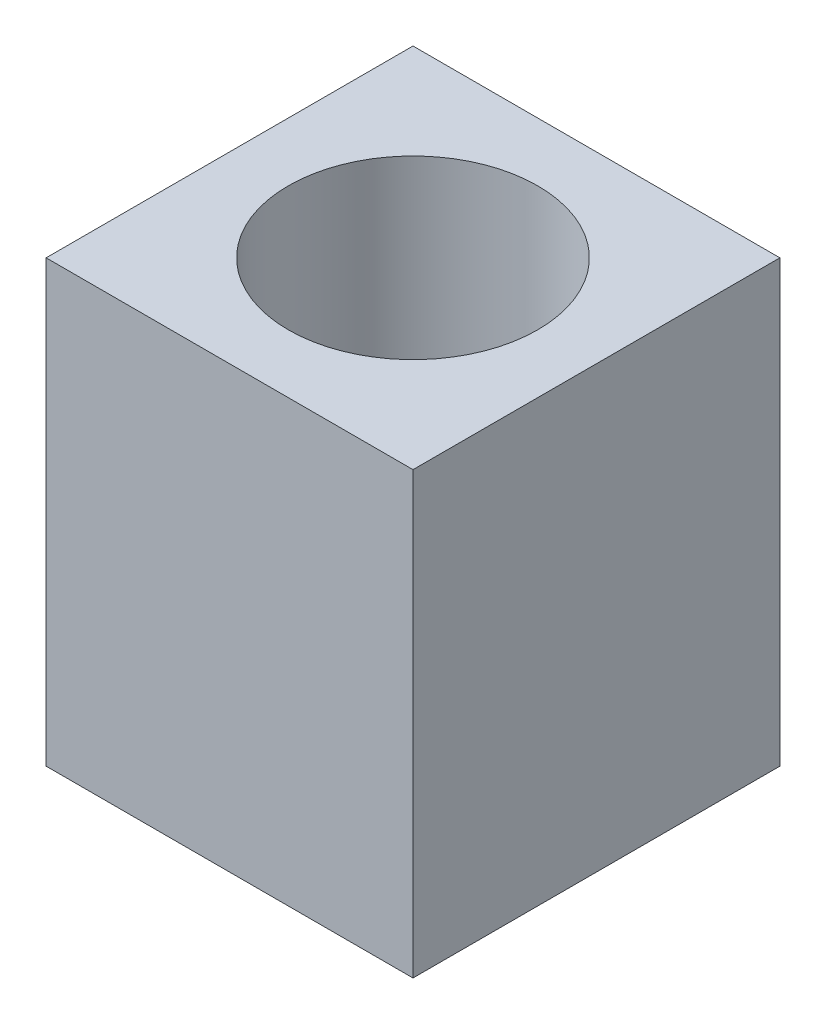
ISO-10303-21;
HEADER;
FILE_DESCRIPTION(('STEP AP214'),'2;1');
FILE_NAME('part.step','',(''),(''),'','','');
FILE_SCHEMA(('AUTOMOTIVE_DESIGN { 1 0 10303 214 1 1 1 1 }'));
ENDSEC;
DATA;
#1=APPLICATION_CONTEXT('core data for automotive mechanical design processes');
#2=APPLICATION_PROTOCOL_DEFINITION('international standard','automotive_design',2000,#1);
#3=PRODUCT_CONTEXT('',#1,'mechanical');
#4=PRODUCT('Part','Part','',(#3));
#5=PRODUCT_RELATED_PRODUCT_CATEGORY('part','',(#4));
#6=PRODUCT_DEFINITION_FORMATION('','',#4);
#7=PRODUCT_DEFINITION_CONTEXT('part definition',#1,'design');
#8=PRODUCT_DEFINITION('design','',#6,#7);
#9=PRODUCT_DEFINITION_SHAPE('','',#8);
#10=(LENGTH_UNIT() NAMED_UNIT(*) SI_UNIT(.MILLI.,.METRE.));
#11=(NAMED_UNIT(*) PLANE_ANGLE_UNIT() SI_UNIT($,.RADIAN.));
#12=(NAMED_UNIT(*) SI_UNIT($,.STERADIAN.) SOLID_ANGLE_UNIT());
#13=UNCERTAINTY_MEASURE_WITH_UNIT(LENGTH_MEASURE(1.E-05),#10,'distance_accuracy_value','');
#14=(GEOMETRIC_REPRESENTATION_CONTEXT(3) GLOBAL_UNCERTAINTY_ASSIGNED_CONTEXT((#13)) GLOBAL_UNIT_ASSIGNED_CONTEXT((#10,
#11,#12)) REPRESENTATION_CONTEXT('',''));
#15=CARTESIAN_POINT('',(0.,0.,0.));
#16=DIRECTION('',(0.,0.,1.));
#17=DIRECTION('',(1.,0.,0.));
#18=AXIS2_PLACEMENT_3D('',#15,#16,#17);
#19=CARTESIAN_POINT('',(0.,6.,0.));
#20=DIRECTION('',(0.,-1.,0.));
#21=DIRECTION('',(0.,0.,-1.));
#22=AXIS2_PLACEMENT_3D('',#19,#20,#21);
#23=PLANE('',#22);
#24=DIRECTION('',(0.,0.,-1.));
#25=VECTOR('',#24,1.);
#26=CARTESIAN_POINT('',(2.5,6.,2.5));
#27=LINE('',#26,#25);
#28=CARTESIAN_POINT('',(2.5,6.,2.5));
#29=VERTEX_POINT('',#28);
#30=CARTESIAN_POINT('',(2.5,6.,-2.5));
#31=VERTEX_POINT('',#30);
#32=EDGE_CURVE('E92',#29,#31,#27,.T.);
#33=ORIENTED_EDGE('',*,*,#32,.T.);
#34=DIRECTION('',(-1.,0.,0.));
#35=VECTOR('',#34,1.);
#36=CARTESIAN_POINT('',(-2.5,6.,-2.5));
#37=LINE('',#36,#35);
#38=CARTESIAN_POINT('',(-2.5,6.,-2.5));
#39=VERTEX_POINT('',#38);
#40=EDGE_CURVE('E87',#31,#39,#37,.T.);
#41=ORIENTED_EDGE('',*,*,#40,.T.);
#42=DIRECTION('',(0.,0.,1.));
#43=VECTOR('',#42,1.);
#44=CARTESIAN_POINT('',(-2.5,6.,2.5));
#45=LINE('',#44,#43);
#46=CARTESIAN_POINT('',(-2.5,6.,2.5));
#47=VERTEX_POINT('',#46);
#48=EDGE_CURVE('E90',#39,#47,#45,.T.);
#49=ORIENTED_EDGE('',*,*,#48,.T.);
#50=DIRECTION('',(1.,0.,0.));
#51=VECTOR('',#50,1.);
#52=CARTESIAN_POINT('',(-2.5,6.,2.5));
#53=LINE('',#52,#51);
#54=EDGE_CURVE('E57',#47,#29,#53,.T.);
#55=ORIENTED_EDGE('',*,*,#54,.T.);
#56=EDGE_LOOP('',(#33,#41,#49,#55));
#57=FACE_BOUND('',#56,.T.);
#58=CARTESIAN_POINT('',(0.,6.,0.));
#59=DIRECTION('',(0.,1.,0.));
#60=DIRECTION('',(0.,0.,1.));
#61=AXIS2_PLACEMENT_3D('',#58,#59,#60);
#62=CIRCLE('',#61,1.7);
#63=CARTESIAN_POINT('',(0.,6.,1.7));
#64=VERTEX_POINT('',#63);
#65=EDGE_CURVE('E112',#64,#64,#62,.T.);
#66=ORIENTED_EDGE('',*,*,#65,.F.);
#67=EDGE_LOOP('',(#66));
#68=FACE_BOUND('',#67,.T.);
#69=ADVANCED_FACE('F39',(#57,#68),#23,.F.);
#70=CARTESIAN_POINT('',(0.,0.,0.));
#71=DIRECTION('',(0.,-1.,0.));
#72=DIRECTION('',(0.,0.,-1.));
#73=AXIS2_PLACEMENT_3D('',#70,#71,#72);
#74=PLANE('',#73);
#75=DIRECTION('',(0.,0.,-1.));
#76=VECTOR('',#75,1.);
#77=CARTESIAN_POINT('',(2.5,0.,2.5));
#78=LINE('',#77,#76);
#79=CARTESIAN_POINT('',(2.5,0.,2.5));
#80=VERTEX_POINT('',#79);
#81=CARTESIAN_POINT('',(2.5,0.,-2.5));
#82=VERTEX_POINT('',#81);
#83=EDGE_CURVE('E108',#80,#82,#78,.T.);
#84=ORIENTED_EDGE('',*,*,#83,.F.);
#85=DIRECTION('',(1.,0.,0.));
#86=VECTOR('',#85,1.);
#87=CARTESIAN_POINT('',(-2.5,0.,2.5));
#88=LINE('',#87,#86);
#89=CARTESIAN_POINT('',(-2.5,0.,2.5));
#90=VERTEX_POINT('',#89);
#91=EDGE_CURVE('E80',#90,#80,#88,.T.);
#92=ORIENTED_EDGE('',*,*,#91,.F.);
#93=DIRECTION('',(0.,0.,1.));
#94=VECTOR('',#93,1.);
#95=CARTESIAN_POINT('',(-2.5,0.,2.5));
#96=LINE('',#95,#94);
#97=CARTESIAN_POINT('',(-2.5,0.,-2.5));
#98=VERTEX_POINT('',#97);
#99=EDGE_CURVE('E74',#98,#90,#96,.T.);
#100=ORIENTED_EDGE('',*,*,#99,.F.);
#101=DIRECTION('',(-1.,0.,0.));
#102=VECTOR('',#101,1.);
#103=CARTESIAN_POINT('',(-2.5,0.,-2.5));
#104=LINE('',#103,#102);
#105=EDGE_CURVE('E97',#82,#98,#104,.T.);
#106=ORIENTED_EDGE('',*,*,#105,.F.);
#107=EDGE_LOOP('',(#84,#92,#100,#106));
#108=FACE_BOUND('',#107,.T.);
#109=CARTESIAN_POINT('',(0.,0.,0.));
#110=DIRECTION('',(0.,1.,0.));
#111=DIRECTION('',(0.,0.,1.));
#112=AXIS2_PLACEMENT_3D('',#109,#110,#111);
#113=CIRCLE('',#112,1.7);
#114=CARTESIAN_POINT('',(0.,0.,1.7));
#115=VERTEX_POINT('',#114);
#116=EDGE_CURVE('E130',#115,#115,#113,.T.);
#117=ORIENTED_EDGE('',*,*,#116,.T.);
#118=EDGE_LOOP('',(#117));
#119=FACE_BOUND('',#118,.T.);
#120=ADVANCED_FACE('F125',(#108,#119),#74,.T.);
#121=CARTESIAN_POINT('',(2.5,6.,2.5));
#122=DIRECTION('',(-1.,0.,0.));
#123=DIRECTION('',(0.,0.,1.));
#124=AXIS2_PLACEMENT_3D('',#121,#122,#123);
#125=PLANE('',#124);
#126=ORIENTED_EDGE('',*,*,#83,.T.);
#127=DIRECTION('',(0.,-1.,0.));
#128=VECTOR('',#127,1.);
#129=CARTESIAN_POINT('',(2.5,6.,-2.5));
#130=LINE('',#129,#128);
#131=EDGE_CURVE('E11',#31,#82,#130,.T.);
#132=ORIENTED_EDGE('',*,*,#131,.F.);
#133=ORIENTED_EDGE('',*,*,#32,.F.);
#134=DIRECTION('',(0.,-1.,0.));
#135=VECTOR('',#134,1.);
#136=CARTESIAN_POINT('',(2.5,6.,2.5));
#137=LINE('',#136,#135);
#138=EDGE_CURVE('E104',#29,#80,#137,.T.);
#139=ORIENTED_EDGE('',*,*,#138,.T.);
#140=EDGE_LOOP('',(#126,#132,#133,#139));
#141=FACE_BOUND('',#140,.T.);
#142=ADVANCED_FACE('F41',(#141),#125,.F.);
#143=CARTESIAN_POINT('',(-2.5,6.,-2.5));
#144=DIRECTION('',(0.,0.,1.));
#145=DIRECTION('',(1.,0.,0.));
#146=AXIS2_PLACEMENT_3D('',#143,#144,#145);
#147=PLANE('',#146);
#148=ORIENTED_EDGE('',*,*,#105,.T.);
#149=DIRECTION('',(0.,-1.,0.));
#150=VECTOR('',#149,1.);
#151=CARTESIAN_POINT('',(-2.5,6.,-2.5));
#152=LINE('',#151,#150);
#153=EDGE_CURVE('E49',#39,#98,#152,.T.);
#154=ORIENTED_EDGE('',*,*,#153,.F.);
#155=ORIENTED_EDGE('',*,*,#40,.F.);
#156=ORIENTED_EDGE('',*,*,#131,.T.);
#157=EDGE_LOOP('',(#148,#154,#155,#156));
#158=FACE_BOUND('',#157,.T.);
#159=ADVANCED_FACE('F96',(#158),#147,.F.);
#160=CARTESIAN_POINT('',(-2.5,6.,2.5));
#161=DIRECTION('',(1.,0.,0.));
#162=DIRECTION('',(0.,0.,-1.));
#163=AXIS2_PLACEMENT_3D('',#160,#161,#162);
#164=PLANE('',#163);
#165=ORIENTED_EDGE('',*,*,#99,.T.);
#166=DIRECTION('',(0.,-1.,0.));
#167=VECTOR('',#166,1.);
#168=CARTESIAN_POINT('',(-2.5,6.,2.5));
#169=LINE('',#168,#167);
#170=EDGE_CURVE('E99',#47,#90,#169,.T.);
#171=ORIENTED_EDGE('',*,*,#170,.F.);
#172=ORIENTED_EDGE('',*,*,#48,.F.);
#173=ORIENTED_EDGE('',*,*,#153,.T.);
#174=EDGE_LOOP('',(#165,#171,#172,#173));
#175=FACE_BOUND('',#174,.T.);
#176=ADVANCED_FACE('F100',(#175),#164,.F.);
#177=CARTESIAN_POINT('',(-2.5,6.,2.5));
#178=DIRECTION('',(0.,0.,-1.));
#179=DIRECTION('',(-1.,0.,0.));
#180=AXIS2_PLACEMENT_3D('',#177,#178,#179);
#181=PLANE('',#180);
#182=ORIENTED_EDGE('',*,*,#91,.T.);
#183=ORIENTED_EDGE('',*,*,#138,.F.);
#184=ORIENTED_EDGE('',*,*,#54,.F.);
#185=ORIENTED_EDGE('',*,*,#170,.T.);
#186=EDGE_LOOP('',(#182,#183,#184,#185));
#187=FACE_BOUND('',#186,.T.);
#188=ADVANCED_FACE('F122',(#187),#181,.F.);
#189=CARTESIAN_POINT('',(0.,6.,0.));
#190=DIRECTION('',(0.,-1.,0.));
#191=DIRECTION('',(0.,0.,-1.));
#192=AXIS2_PLACEMENT_3D('',#189,#190,#191);
#193=CYLINDRICAL_SURFACE('',#192,1.7);
#194=ORIENTED_EDGE('',*,*,#65,.T.);
#195=EDGE_LOOP('',(#194));
#196=FACE_BOUND('',#195,.T.);
#197=ORIENTED_EDGE('',*,*,#116,.F.);
#198=EDGE_LOOP('',(#197));
#199=FACE_BOUND('',#198,.T.);
#200=ADVANCED_FACE('F138',(#196,#199),#193,.F.);
#201=CLOSED_SHELL('',(#69,#120,#142,#159,#176,#188,#200));
#202=MANIFOLD_SOLID_BREP('B2',#201);
#203=ADVANCED_BREP_SHAPE_REPRESENTATION('',(#18,#202),#14);
#204=SHAPE_DEFINITION_REPRESENTATION(#9,#203);
ENDSEC;
END-ISO-10303-21;
